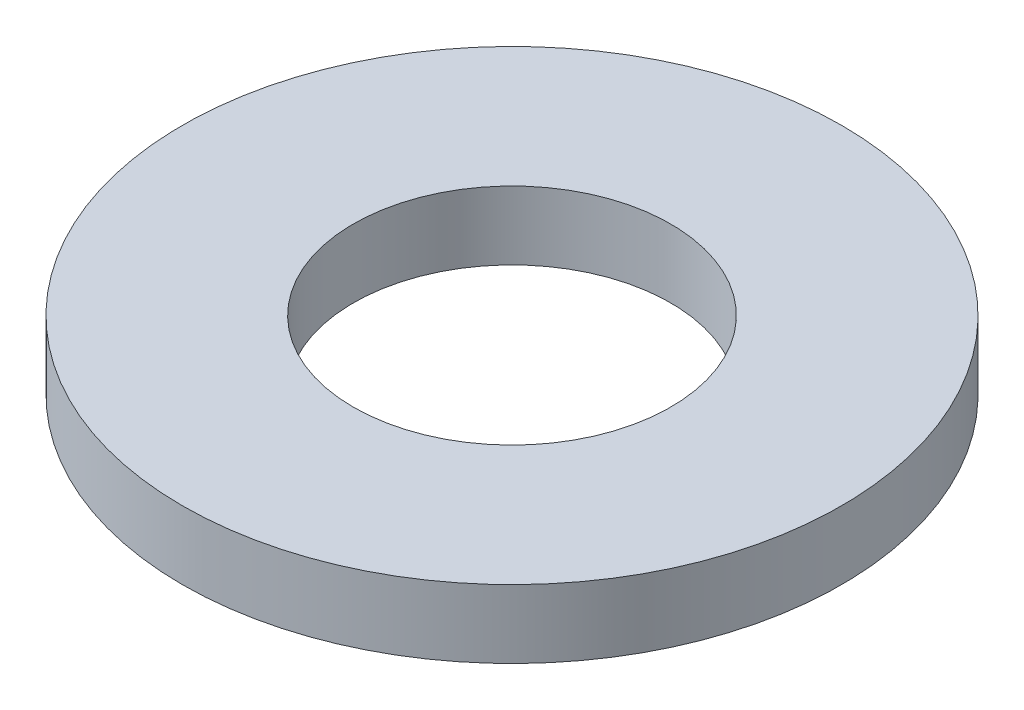
ISO-10303-21;
HEADER;
FILE_DESCRIPTION(('STEP AP214'),'2;1');
FILE_NAME('part.step','',(''),(''),'','','');
FILE_SCHEMA(('AUTOMOTIVE_DESIGN { 1 0 10303 214 1 1 1 1 }'));
ENDSEC;
DATA;
#1=APPLICATION_CONTEXT('core data for automotive mechanical design processes');
#2=APPLICATION_PROTOCOL_DEFINITION('international standard','automotive_design',2000,#1);
#3=PRODUCT_CONTEXT('',#1,'mechanical');
#4=PRODUCT('Part','Part','',(#3));
#5=PRODUCT_RELATED_PRODUCT_CATEGORY('part','',(#4));
#6=PRODUCT_DEFINITION_FORMATION('','',#4);
#7=PRODUCT_DEFINITION_CONTEXT('part definition',#1,'design');
#8=PRODUCT_DEFINITION('design','',#6,#7);
#9=PRODUCT_DEFINITION_SHAPE('','',#8);
#10=(LENGTH_UNIT() NAMED_UNIT(*) SI_UNIT(.MILLI.,.METRE.));
#11=(NAMED_UNIT(*) PLANE_ANGLE_UNIT() SI_UNIT($,.RADIAN.));
#12=(NAMED_UNIT(*) SI_UNIT($,.STERADIAN.) SOLID_ANGLE_UNIT());
#13=UNCERTAINTY_MEASURE_WITH_UNIT(LENGTH_MEASURE(1.E-05),#10,'distance_accuracy_value','');
#14=(GEOMETRIC_REPRESENTATION_CONTEXT(3) GLOBAL_UNCERTAINTY_ASSIGNED_CONTEXT((#13)) GLOBAL_UNIT_ASSIGNED_CONTEXT((#10,
#11,#12)) REPRESENTATION_CONTEXT('',''));
#15=CARTESIAN_POINT('',(0.,0.,0.));
#16=DIRECTION('',(0.,0.,1.));
#17=DIRECTION('',(1.,0.,0.));
#18=AXIS2_PLACEMENT_3D('',#15,#16,#17);
#19=CARTESIAN_POINT('',(0.,14.,0.));
#20=DIRECTION('',(0.,-1.,0.));
#21=DIRECTION('',(0.,0.,-1.));
#22=AXIS2_PLACEMENT_3D('',#19,#20,#21);
#23=CYLINDRICAL_SURFACE('',#22,67.5);
#24=CARTESIAN_POINT('',(0.,14.,0.));
#25=DIRECTION('',(0.,1.,0.));
#26=DIRECTION('',(0.,0.,1.));
#27=AXIS2_PLACEMENT_3D('',#24,#25,#26);
#28=CIRCLE('',#27,67.5);
#29=CARTESIAN_POINT('',(0.,14.,67.5));
#30=VERTEX_POINT('',#29);
#31=EDGE_CURVE('E10',#30,#30,#28,.T.);
#32=ORIENTED_EDGE('',*,*,#31,.F.);
#33=EDGE_LOOP('',(#32));
#34=FACE_BOUND('',#33,.T.);
#35=CARTESIAN_POINT('',(0.,0.,0.));
#36=DIRECTION('',(0.,1.,0.));
#37=DIRECTION('',(0.,0.,1.));
#38=AXIS2_PLACEMENT_3D('',#35,#36,#37);
#39=CIRCLE('',#38,67.5);
#40=CARTESIAN_POINT('',(0.,0.,67.5));
#41=VERTEX_POINT('',#40);
#42=EDGE_CURVE('E37',#41,#41,#39,.T.);
#43=ORIENTED_EDGE('',*,*,#42,.T.);
#44=EDGE_LOOP('',(#43));
#45=FACE_BOUND('',#44,.T.);
#46=ADVANCED_FACE('F40',(#34,#45),#23,.T.);
#47=CARTESIAN_POINT('',(0.,14.,0.));
#48=DIRECTION('',(0.,1.,0.));
#49=DIRECTION('',(0.,0.,1.));
#50=AXIS2_PLACEMENT_3D('',#47,#48,#49);
#51=PLANE('',#50);
#52=CARTESIAN_POINT('',(0.,14.,0.));
#53=DIRECTION('',(0.,1.,0.));
#54=DIRECTION('',(0.,0.,1.));
#55=AXIS2_PLACEMENT_3D('',#52,#53,#54);
#56=CIRCLE('',#55,32.5);
#57=CARTESIAN_POINT('',(0.,14.,32.5));
#58=VERTEX_POINT('',#57);
#59=EDGE_CURVE('E50',#58,#58,#56,.T.);
#60=ORIENTED_EDGE('',*,*,#59,.F.);
#61=EDGE_LOOP('',(#60));
#62=FACE_BOUND('',#61,.T.);
#63=ORIENTED_EDGE('',*,*,#31,.T.);
#64=EDGE_LOOP('',(#63));
#65=FACE_BOUND('',#64,.T.);
#66=ADVANCED_FACE('F59',(#62,#65),#51,.T.);
#67=CARTESIAN_POINT('',(0.,0.,0.));
#68=DIRECTION('',(0.,1.,0.));
#69=DIRECTION('',(0.,0.,1.));
#70=AXIS2_PLACEMENT_3D('',#67,#68,#69);
#71=PLANE('',#70);
#72=CARTESIAN_POINT('',(0.,0.,0.));
#73=DIRECTION('',(0.,1.,0.));
#74=DIRECTION('',(0.,0.,1.));
#75=AXIS2_PLACEMENT_3D('',#72,#73,#74);
#76=CIRCLE('',#75,32.5);
#77=CARTESIAN_POINT('',(0.,0.,32.5));
#78=VERTEX_POINT('',#77);
#79=EDGE_CURVE('E47',#78,#78,#76,.T.);
#80=ORIENTED_EDGE('',*,*,#79,.T.);
#81=EDGE_LOOP('',(#80));
#82=FACE_BOUND('',#81,.T.);
#83=ORIENTED_EDGE('',*,*,#42,.F.);
#84=EDGE_LOOP('',(#83));
#85=FACE_BOUND('',#84,.T.);
#86=ADVANCED_FACE('F58',(#82,#85),#71,.F.);
#87=CARTESIAN_POINT('',(0.,14.,0.));
#88=DIRECTION('',(0.,-1.,0.));
#89=DIRECTION('',(0.,0.,-1.));
#90=AXIS2_PLACEMENT_3D('',#87,#88,#89);
#91=CYLINDRICAL_SURFACE('',#90,32.5);
#92=ORIENTED_EDGE('',*,*,#59,.T.);
#93=EDGE_LOOP('',(#92));
#94=FACE_BOUND('',#93,.T.);
#95=ORIENTED_EDGE('',*,*,#79,.F.);
#96=EDGE_LOOP('',(#95));
#97=FACE_BOUND('',#96,.T.);
#98=ADVANCED_FACE('F54',(#94,#97),#91,.F.);
#99=CLOSED_SHELL('',(#46,#66,#86,#98));
#100=MANIFOLD_SOLID_BREP('B2',#99);
#101=ADVANCED_BREP_SHAPE_REPRESENTATION('',(#18,#100),#14);
#102=SHAPE_DEFINITION_REPRESENTATION(#9,#101);
ENDSEC;
END-ISO-10303-21;
